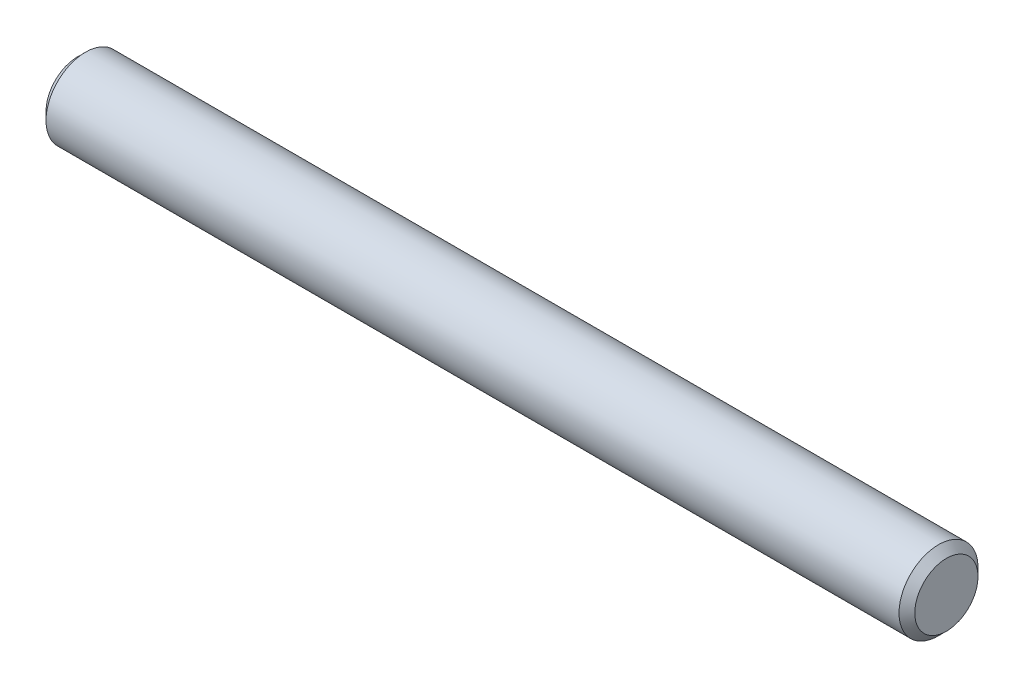
ISO-10303-21;
HEADER;
FILE_DESCRIPTION(('STEP AP214'),'2;1');
FILE_NAME('part.step','',(''),(''),'','','');
FILE_SCHEMA(('AUTOMOTIVE_DESIGN { 1 0 10303 214 1 1 1 1 }'));
ENDSEC;
DATA;
#1=APPLICATION_CONTEXT('core data for automotive mechanical design processes');
#2=APPLICATION_PROTOCOL_DEFINITION('international standard','automotive_design',2000,#1);
#3=PRODUCT_CONTEXT('',#1,'mechanical');
#4=PRODUCT('Part','Part','',(#3));
#5=PRODUCT_RELATED_PRODUCT_CATEGORY('part','',(#4));
#6=PRODUCT_DEFINITION_FORMATION('','',#4);
#7=PRODUCT_DEFINITION_CONTEXT('part definition',#1,'design');
#8=PRODUCT_DEFINITION('design','',#6,#7);
#9=PRODUCT_DEFINITION_SHAPE('','',#8);
#10=(LENGTH_UNIT() NAMED_UNIT(*) SI_UNIT(.MILLI.,.METRE.));
#11=(NAMED_UNIT(*) PLANE_ANGLE_UNIT() SI_UNIT($,.RADIAN.));
#12=(NAMED_UNIT(*) SI_UNIT($,.STERADIAN.) SOLID_ANGLE_UNIT());
#13=UNCERTAINTY_MEASURE_WITH_UNIT(LENGTH_MEASURE(1.E-05),#10,'distance_accuracy_value','');
#14=(GEOMETRIC_REPRESENTATION_CONTEXT(3) GLOBAL_UNCERTAINTY_ASSIGNED_CONTEXT((#13)) GLOBAL_UNIT_ASSIGNED_CONTEXT((#10,
#11,#12)) REPRESENTATION_CONTEXT('',''));
#15=CARTESIAN_POINT('',(0.,0.,0.));
#16=DIRECTION('',(0.,0.,1.));
#17=DIRECTION('',(1.,0.,0.));
#18=AXIS2_PLACEMENT_3D('',#15,#16,#17);
#19=CARTESIAN_POINT('',(11.,0.,0.));
#20=DIRECTION('',(1.,0.,0.));
#21=DIRECTION('',(0.,0.,-1.));
#22=AXIS2_PLACEMENT_3D('',#19,#20,#21);
#23=PLANE('',#22);
#24=CARTESIAN_POINT('',(10.9999999999673,0.,0.));
#25=DIRECTION('',(-1.,0.,0.));
#26=DIRECTION('',(0.,0.,1.));
#27=AXIS2_PLACEMENT_3D('',#24,#25,#26);
#28=CIRCLE('',#27,0.800000000026557);
#29=CARTESIAN_POINT('',(10.9999999999673,0.,0.800000000026557));
#30=VERTEX_POINT('',#29);
#31=EDGE_CURVE('E18',#30,#30,#28,.T.);
#32=ORIENTED_EDGE('',*,*,#31,.F.);
#33=EDGE_LOOP('',(#32));
#34=FACE_BOUND('',#33,.T.);
#35=ADVANCED_FACE('F15',(#34),#23,.T.);
#36=CARTESIAN_POINT('',(-11.,0.,0.));
#37=DIRECTION('',(-1.,0.,0.));
#38=DIRECTION('',(0.,0.,1.));
#39=AXIS2_PLACEMENT_3D('',#36,#37,#38);
#40=PLANE('',#39);
#41=CARTESIAN_POINT('',(-10.9999999999673,0.,0.));
#42=DIRECTION('',(1.,0.,0.));
#43=DIRECTION('',(0.,0.,-1.));
#44=AXIS2_PLACEMENT_3D('',#41,#42,#43);
#45=CIRCLE('',#44,0.800000000026557);
#46=CARTESIAN_POINT('',(-10.9999999999673,0.,-0.800000000026557));
#47=VERTEX_POINT('',#46);
#48=EDGE_CURVE('E27',#47,#47,#45,.T.);
#49=ORIENTED_EDGE('',*,*,#48,.F.);
#50=EDGE_LOOP('',(#49));
#51=FACE_BOUND('',#50,.T.);
#52=ADVANCED_FACE('F38',(#51),#40,.T.);
#53=CARTESIAN_POINT('',(10.8000000001311,0.,0.));
#54=DIRECTION('',(-1.,0.,0.));
#55=DIRECTION('',(0.,0.,1.));
#56=AXIS2_PLACEMENT_3D('',#53,#54,#55);
#57=CONICAL_SURFACE('',#56,0.999999999862666,0.785398163397448);
#58=CARTESIAN_POINT('',(10.8,0.,0.));
#59=DIRECTION('',(-1.,0.,0.));
#60=DIRECTION('',(0.,0.,1.));
#61=AXIS2_PLACEMENT_3D('',#58,#59,#60);
#62=CIRCLE('',#61,1.);
#63=CARTESIAN_POINT('',(10.8,0.,1.));
#64=VERTEX_POINT('',#63);
#65=EDGE_CURVE('E22',#64,#64,#62,.T.);
#66=ORIENTED_EDGE('',*,*,#65,.F.);
#67=EDGE_LOOP('',(#66));
#68=FACE_BOUND('',#67,.T.);
#69=ORIENTED_EDGE('',*,*,#31,.T.);
#70=EDGE_LOOP('',(#69));
#71=FACE_BOUND('',#70,.T.);
#72=ADVANCED_FACE('F35',(#68,#71),#57,.T.);
#73=CARTESIAN_POINT('',(-10.8000000001311,0.,0.));
#74=DIRECTION('',(1.,0.,0.));
#75=DIRECTION('',(0.,0.,-1.));
#76=AXIS2_PLACEMENT_3D('',#73,#74,#75);
#77=CONICAL_SURFACE('',#76,0.999999999862666,0.785398163397448);
#78=CARTESIAN_POINT('',(-10.8,0.,0.));
#79=DIRECTION('',(-1.,0.,0.));
#80=DIRECTION('',(0.,0.,1.));
#81=AXIS2_PLACEMENT_3D('',#78,#79,#80);
#82=CIRCLE('',#81,1.);
#83=CARTESIAN_POINT('',(-10.8,0.,1.));
#84=VERTEX_POINT('',#83);
#85=EDGE_CURVE('E10',#84,#84,#82,.F.);
#86=ORIENTED_EDGE('',*,*,#85,.F.);
#87=EDGE_LOOP('',(#86));
#88=FACE_BOUND('',#87,.T.);
#89=ORIENTED_EDGE('',*,*,#48,.T.);
#90=EDGE_LOOP('',(#89));
#91=FACE_BOUND('',#90,.T.);
#92=ADVANCED_FACE('F46',(#88,#91),#77,.T.);
#93=CARTESIAN_POINT('',(-8.3,0.,0.));
#94=DIRECTION('',(-1.,0.,0.));
#95=DIRECTION('',(0.,0.,1.));
#96=AXIS2_PLACEMENT_3D('',#93,#94,#95);
#97=CYLINDRICAL_SURFACE('',#96,1.);
#98=ORIENTED_EDGE('',*,*,#85,.T.);
#99=EDGE_LOOP('',(#98));
#100=FACE_BOUND('',#99,.T.);
#101=ORIENTED_EDGE('',*,*,#65,.T.);
#102=EDGE_LOOP('',(#101));
#103=FACE_BOUND('',#102,.T.);
#104=ADVANCED_FACE('F44',(#100,#103),#97,.T.);
#105=CLOSED_SHELL('',(#35,#52,#72,#92,#104));
#106=MANIFOLD_SOLID_BREP('B1',#105);
#107=ADVANCED_BREP_SHAPE_REPRESENTATION('',(#18,#106),#14);
#108=SHAPE_DEFINITION_REPRESENTATION(#9,#107);
ENDSEC;
END-ISO-10303-21;
